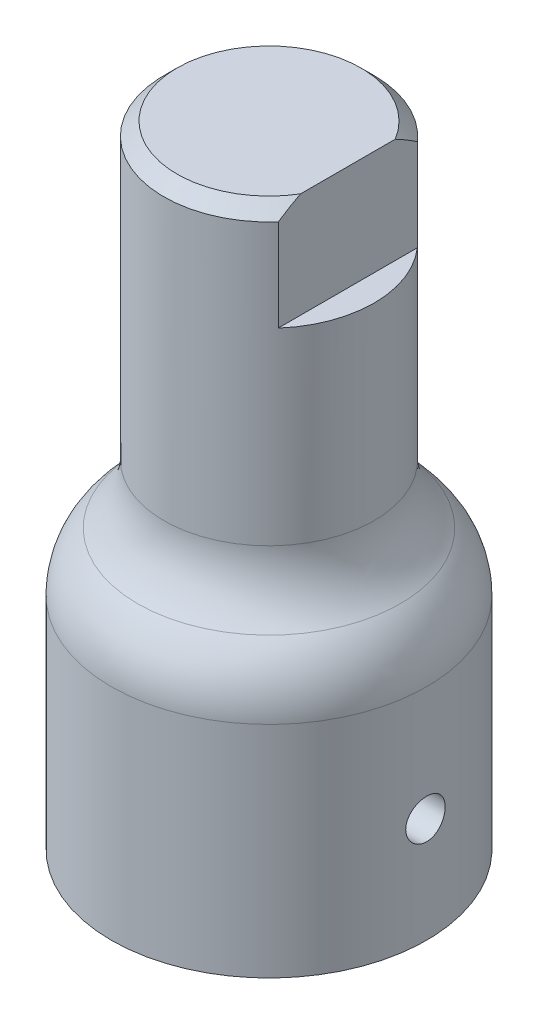
ISO-10303-21;
HEADER;
FILE_DESCRIPTION(('STEP AP214'),'2;1');
FILE_NAME('part.step','',(''),(''),'','','');
FILE_SCHEMA(('AUTOMOTIVE_DESIGN { 1 0 10303 214 1 1 1 1 }'));
ENDSEC;
DATA;
#1=APPLICATION_CONTEXT('core data for automotive mechanical design processes');
#2=APPLICATION_PROTOCOL_DEFINITION('international standard','automotive_design',2000,#1);
#3=PRODUCT_CONTEXT('',#1,'mechanical');
#4=PRODUCT('Part','Part','',(#3));
#5=PRODUCT_RELATED_PRODUCT_CATEGORY('part','',(#4));
#6=PRODUCT_DEFINITION_FORMATION('','',#4);
#7=PRODUCT_DEFINITION_CONTEXT('part definition',#1,'design');
#8=PRODUCT_DEFINITION('design','',#6,#7);
#9=PRODUCT_DEFINITION_SHAPE('','',#8);
#10=(LENGTH_UNIT() NAMED_UNIT(*) SI_UNIT(.MILLI.,.METRE.));
#11=(NAMED_UNIT(*) PLANE_ANGLE_UNIT() SI_UNIT($,.RADIAN.));
#12=(NAMED_UNIT(*) SI_UNIT($,.STERADIAN.) SOLID_ANGLE_UNIT());
#13=UNCERTAINTY_MEASURE_WITH_UNIT(LENGTH_MEASURE(1.E-05),#10,'distance_accuracy_value','');
#14=(GEOMETRIC_REPRESENTATION_CONTEXT(3) GLOBAL_UNCERTAINTY_ASSIGNED_CONTEXT((#13)) GLOBAL_UNIT_ASSIGNED_CONTEXT((#10,
#11,#12)) REPRESENTATION_CONTEXT('',''));
#15=CARTESIAN_POINT('',(0.,0.,0.));
#16=DIRECTION('',(0.,0.,1.));
#17=DIRECTION('',(1.,0.,0.));
#18=AXIS2_PLACEMENT_3D('',#15,#16,#17);
#19=CARTESIAN_POINT('',(0.,38.1,0.));
#20=DIRECTION('',(0.,-1.,0.));
#21=DIRECTION('',(0.,0.,-1.));
#22=AXIS2_PLACEMENT_3D('',#19,#20,#21);
#23=CYLINDRICAL_SURFACE('',#22,6.35);
#24=CARTESIAN_POINT('',(0.,20.3651280605346,0.));
#25=DIRECTION('',(0.,-1.,0.));
#26=DIRECTION('',(0.,0.,-1.));
#27=AXIS2_PLACEMENT_3D('',#24,#25,#26);
#28=CIRCLE('',#27,6.35);
#29=CARTESIAN_POINT('',(0.,20.3651280605346,-6.35000000000001));
#30=VERTEX_POINT('',#29);
#31=EDGE_CURVE('E146',#30,#30,#28,.F.);
#32=ORIENTED_EDGE('',*,*,#31,.T.);
#33=EDGE_LOOP('',(#32));
#34=FACE_BOUND('',#33,.T.);
#35=DIRECTION('',(0.,1.,0.));
#36=VECTOR('',#35,1.);
#37=CARTESIAN_POINT('',(4.7625,31.75,4.20013020631504));
#38=LINE('',#37,#36);
#39=CARTESIAN_POINT('',(4.7625,31.75,4.20013020631504));
#40=VERTEX_POINT('',#39);
#41=CARTESIAN_POINT('',(4.7625,37.30625,4.20013020631504));
#42=VERTEX_POINT('',#41);
#43=EDGE_CURVE('E79',#40,#42,#38,.T.);
#44=ORIENTED_EDGE('',*,*,#43,.T.);
#45=CARTESIAN_POINT('',(0.,37.30625,0.));
#46=DIRECTION('',(0.,1.,0.));
#47=DIRECTION('',(0.,0.,1.));
#48=AXIS2_PLACEMENT_3D('',#45,#46,#47);
#49=CIRCLE('',#48,6.35);
#50=CARTESIAN_POINT('',(4.7625,37.30625,-4.20013020631508));
#51=VERTEX_POINT('',#50);
#52=EDGE_CURVE('E11',#42,#51,#49,.F.);
#53=ORIENTED_EDGE('',*,*,#52,.T.);
#54=DIRECTION('',(0.,1.,0.));
#55=VECTOR('',#54,1.);
#56=CARTESIAN_POINT('',(4.7625,31.75,-4.20013020631508));
#57=LINE('',#56,#55);
#58=CARTESIAN_POINT('',(4.7625,31.75,-4.20013020631508));
#59=VERTEX_POINT('',#58);
#60=EDGE_CURVE('E77',#59,#51,#57,.T.);
#61=ORIENTED_EDGE('',*,*,#60,.F.);
#62=CARTESIAN_POINT('',(0.,31.75,0.));
#63=DIRECTION('',(0.,1.,0.));
#64=DIRECTION('',(0.,0.,1.));
#65=AXIS2_PLACEMENT_3D('',#62,#63,#64);
#66=CIRCLE('',#65,6.35);
#67=EDGE_CURVE('E82',#40,#59,#66,.T.);
#68=ORIENTED_EDGE('',*,*,#67,.F.);
#69=EDGE_LOOP('',(#44,#53,#61,#68));
#70=FACE_BOUND('',#69,.T.);
#71=ADVANCED_FACE('F32',(#34,#70),#23,.T.);
#72=CARTESIAN_POINT('',(0.,38.1,0.));
#73=DIRECTION('',(0.,1.,0.));
#74=DIRECTION('',(0.,0.,1.));
#75=AXIS2_PLACEMENT_3D('',#72,#73,#74);
#76=PLANE('',#75);
#77=DIRECTION('',(0.,0.,-1.));
#78=VECTOR('',#77,1.);
#79=CARTESIAN_POINT('',(4.7625,38.1,4.20013020631504));
#80=LINE('',#79,#78);
#81=CARTESIAN_POINT('',(4.7625,38.1,2.86190632489951));
#82=VERTEX_POINT('',#81);
#83=CARTESIAN_POINT('',(4.7625,38.1,-2.86190632489951));
#84=VERTEX_POINT('',#83);
#85=EDGE_CURVE('E85',#82,#84,#80,.T.);
#86=ORIENTED_EDGE('',*,*,#85,.T.);
#87=CARTESIAN_POINT('',(0.,38.1,0.));
#88=DIRECTION('',(0.,1.,0.));
#89=DIRECTION('',(0.,0.,1.));
#90=AXIS2_PLACEMENT_3D('',#87,#88,#89);
#91=CIRCLE('',#90,5.55624999999999);
#92=EDGE_CURVE('E161',#84,#82,#91,.T.);
#93=ORIENTED_EDGE('',*,*,#92,.T.);
#94=EDGE_LOOP('',(#86,#93));
#95=FACE_BOUND('',#94,.T.);
#96=ADVANCED_FACE('F138',(#95),#76,.T.);
#97=CARTESIAN_POINT('',(0.,0.,0.));
#98=DIRECTION('',(0.,1.,0.));
#99=DIRECTION('',(0.,0.,1.));
#100=AXIS2_PLACEMENT_3D('',#97,#98,#99);
#101=PLANE('',#100);
#102=CARTESIAN_POINT('',(0.,0.,0.));
#103=DIRECTION('',(0.,1.,0.));
#104=DIRECTION('',(0.,0.,1.));
#105=AXIS2_PLACEMENT_3D('',#102,#103,#104);
#106=CIRCLE('',#105,9.525);
#107=CARTESIAN_POINT('',(0.,0.,9.52500000000001));
#108=VERTEX_POINT('',#107);
#109=EDGE_CURVE('E149',#108,#108,#106,.T.);
#110=ORIENTED_EDGE('',*,*,#109,.F.);
#111=EDGE_LOOP('',(#110));
#112=FACE_BOUND('',#111,.T.);
#113=CARTESIAN_POINT('',(0.,0.,0.));
#114=DIRECTION('',(0.,1.,0.));
#115=DIRECTION('',(0.,0.,1.));
#116=AXIS2_PLACEMENT_3D('',#113,#114,#115);
#117=CIRCLE('',#116,6.35);
#118=CARTESIAN_POINT('',(4.7625,0.,-4.20013020631508));
#119=VERTEX_POINT('',#118);
#120=CARTESIAN_POINT('',(4.7625,0.,4.20013020631504));
#121=VERTEX_POINT('',#120);
#122=EDGE_CURVE('E100',#119,#121,#117,.T.);
#123=ORIENTED_EDGE('',*,*,#122,.T.);
#124=DIRECTION('',(0.,0.,-1.));
#125=VECTOR('',#124,1.);
#126=CARTESIAN_POINT('',(4.7625,0.,4.20013020631504));
#127=LINE('',#126,#125);
#128=EDGE_CURVE('E262',#121,#119,#127,.T.);
#129=ORIENTED_EDGE('',*,*,#128,.T.);
#130=EDGE_LOOP('',(#123,#129));
#131=FACE_BOUND('',#130,.T.);
#132=ADVANCED_FACE('F135',(#112,#131),#101,.F.);
#133=CARTESIAN_POINT('',(0.,15.875,0.));
#134=DIRECTION('',(0.,-1.,0.));
#135=DIRECTION('',(0.,0.,-1.));
#136=AXIS2_PLACEMENT_3D('',#133,#134,#135);
#137=CYLINDRICAL_SURFACE('',#136,9.525);
#138=CARTESIAN_POINT('',(9.52500000000002,5.15937499999999,0.));
#139=CARTESIAN_POINT('',(9.52499907081927,5.15937782937063,0.066599321758431));
#140=CARTESIAN_POINT('',(9.52429412394273,5.16498183370437,0.133240259761682));
#141=CARTESIAN_POINT('',(9.52154975978035,5.18724884311434,0.264667746995244));
#142=CARTESIAN_POINT('',(9.51950894913981,5.20392339543601,0.329452286209558));
#143=CARTESIAN_POINT('',(9.51432276572399,5.24783255291408,0.45524526750472));
#144=CARTESIAN_POINT('',(9.51117813655702,5.27506005016194,0.516256219269604));
#145=CARTESIAN_POINT('',(9.50413406293194,5.33928666899061,0.632831224917818));
#146=CARTESIAN_POINT('',(9.50023474798811,5.37628411431275,0.688396210941232));
#147=CARTESIAN_POINT('',(9.49209265522139,5.4592181661111,0.792819479063548));
#148=CARTESIAN_POINT('',(9.48784828372264,5.50519780785114,0.841643461301313));
#149=CARTESIAN_POINT('',(9.47950729512143,5.60469866970932,0.930903392931741));
#150=CARTESIAN_POINT('',(9.47541068555933,5.65822027401493,0.971338914756774));
#151=CARTESIAN_POINT('',(9.46781335551327,5.77150863931565,1.04280183931144));
#152=CARTESIAN_POINT('',(9.4643146875598,5.83129581844673,1.07379711069193));
#153=CARTESIAN_POINT('',(9.45833037427971,5.95527783348992,1.12529449021891));
#154=CARTESIAN_POINT('',(9.45584469053883,6.01947250215376,1.14579699627856));
#155=CARTESIAN_POINT('',(9.45218299236223,6.1500912981482,1.17562263923679));
#156=CARTESIAN_POINT('',(9.4510001961175,6.21650200898162,1.18500368539097));
#157=CARTESIAN_POINT('',(9.45005743403004,6.34996488297846,1.19249930547663));
#158=CARTESIAN_POINT('',(9.45029741096968,6.41701702023828,1.1906143324774));
#159=CARTESIAN_POINT('',(9.45216687494844,6.54945579897724,1.17567895885832));
#160=CARTESIAN_POINT('',(9.45378842328606,6.61484976217788,1.16269234837146));
#161=CARTESIAN_POINT('',(9.45822593884571,6.74252287885555,1.12602186999045));
#162=CARTESIAN_POINT('',(9.46104193026778,6.80480196919507,1.10233778535935));
#163=CARTESIAN_POINT('',(9.46756003930542,6.92467563453408,1.04487609790792));
#164=CARTESIAN_POINT('',(9.4712645849195,6.98225678424357,1.01107077457826));
#165=CARTESIAN_POINT('',(9.47914051318821,7.0909529382143,0.93434604982887));
#166=CARTESIAN_POINT('',(9.48331191719172,7.14206764654497,0.891426231533505));
#167=CARTESIAN_POINT('',(9.49168683585316,7.23675021598171,0.797337326496528));
#168=CARTESIAN_POINT('',(9.49589037311757,7.28026345495354,0.746113256233825));
#169=CARTESIAN_POINT('',(9.50382893754725,7.35808260411454,0.637059226790497));
#170=CARTESIAN_POINT('',(9.50756396363217,7.39238849307253,0.5792292523778));
#171=CARTESIAN_POINT('',(9.51414698744099,7.45081916637093,0.458562870986835));
#172=CARTESIAN_POINT('',(9.51699468708732,7.47494053041093,0.395724790529569));
#173=CARTESIAN_POINT('',(9.52147949227754,7.51227407254045,0.266846656630281));
#174=CARTESIAN_POINT('',(9.52311665449633,7.52548676135527,0.200806753245351));
#175=CARTESIAN_POINT('',(9.52498855290624,7.54055709830409,0.067871894313805));
#176=CARTESIAN_POINT('',(9.5252325821293,7.54248999136338,0.000985594707088864));
#177=CARTESIAN_POINT('',(9.52431580975086,7.53514444165585,-0.13215748738193));
#178=CARTESIAN_POINT('',(9.52315503806674,7.52586623764642,-0.198414283240189));
#179=CARTESIAN_POINT('',(9.51956488620375,7.4964243761962,-0.328195546802372));
#180=CARTESIAN_POINT('',(9.51713968812605,7.47629659642949,-0.391728279164763));
#181=CARTESIAN_POINT('',(9.51129220626468,7.42576423852647,-0.514516523126313));
#182=CARTESIAN_POINT('',(9.50786988862572,7.39535931144345,-0.573771889410353));
#183=CARTESIAN_POINT('',(9.50038655660941,7.32495369326206,-0.686659402977384));
#184=CARTESIAN_POINT('',(9.49632233975244,7.28490432948005,-0.740260978173241));
#185=CARTESIAN_POINT('',(9.48801986532594,7.19641555179933,-0.840008316309541));
#186=CARTESIAN_POINT('',(9.48378160085311,7.14797580486547,-0.886153783157947));
#187=CARTESIAN_POINT('',(9.47558003976556,7.04374984276942,-0.969945970387097));
#188=CARTESIAN_POINT('',(9.47161844586032,6.98792337506967,-1.00754281309548));
#189=CARTESIAN_POINT('',(9.46444677006442,6.87070401088794,-1.07282593859746));
#190=CARTESIAN_POINT('',(9.46123667310902,6.8093112260243,-1.10051242006313));
#191=CARTESIAN_POINT('',(9.45594303749664,6.68286287925594,-1.14510815818519));
#192=CARTESIAN_POINT('',(9.45385656144255,6.61781736343964,-1.16204553632644));
#193=CARTESIAN_POINT('',(9.45103797450925,6.48577769209945,-1.18475283457957));
#194=CARTESIAN_POINT('',(9.4503058006243,6.41878362737452,-1.1905232742077));
#195=CARTESIAN_POINT('',(9.45028055162894,6.28524479746627,-1.19072336281044));
#196=CARTESIAN_POINT('',(9.45097753288118,6.21870013798194,-1.18523137240429));
#197=CARTESIAN_POINT('',(9.45371068298342,6.08748760464941,-1.16322843530948));
#198=CARTESIAN_POINT('',(9.45574685197692,6.02281973100231,-1.14671748744012));
#199=CARTESIAN_POINT('',(9.46092587637629,5.89720676184,-1.1031698188447));
#200=CARTESIAN_POINT('',(9.46406833493563,5.83626034055836,-1.07613687218741));
#201=CARTESIAN_POINT('',(9.47110651770345,5.71975615600948,-1.01232028714908));
#202=CARTESIAN_POINT('',(9.47500225135021,5.6641984602743,-0.975536526591438));
#203=CARTESIAN_POINT('',(9.48314050513251,5.5596482539316,-0.892971765265354));
#204=CARTESIAN_POINT('',(9.4873851658002,5.51070202422019,-0.847132366775326));
#205=CARTESIAN_POINT('',(9.49572411046119,5.42116637451376,-0.747879295593704));
#206=CARTESIAN_POINT('',(9.49981835876251,5.38057892761874,-0.694463839578688));
#207=CARTESIAN_POINT('',(9.50741235699439,5.30878159867861,-0.581342001931836));
#208=CARTESIAN_POINT('',(9.51090978693541,5.27760796494048,-0.521612469407691));
#209=CARTESIAN_POINT('',(9.5168925537279,5.22577794556112,-0.397755857220992));
#210=CARTESIAN_POINT('',(9.51937898969761,5.20511013219917,-0.333633642264451));
#211=CARTESIAN_POINT('',(9.5224602555609,5.17982549019592,-0.224316498899722));
#212=CARTESIAN_POINT('',(9.52340801957709,5.17216757888104,-0.179810884749932));
#213=CARTESIAN_POINT('',(9.52467820420526,5.16194139423859,-0.0902098763549219));
#214=CARTESIAN_POINT('',(9.52500062942854,5.15937308337983,-0.0451144864612328));
#215=CARTESIAN_POINT('',(9.52500000000002,5.15937499999999,0.));
#216=B_SPLINE_CURVE_WITH_KNOTS('',3,(#138,#139,#140,#141,#142,#143,#144,#145,#146,#147,#148,
#149,#150,#151,#152,#153,#154,#155,#156,#157,#158,#159,#160,#161,#162,#163,#164,#165,#166,#167,
#168,#169,#170,#171,#172,#173,#174,#175,#176,#177,#178,#179,#180,#181,#182,#183,#184,#185,#186,
#187,#188,#189,#190,#191,#192,#193,#194,#195,#196,#197,#198,#199,#200,#201,#202,#203,#204,#205,
#206,#207,#208,#209,#210,#211,#212,#213,#214,#215),.UNSPECIFIED.,.T.,.F.,(4,2,2,2,2,2,2,2,2,2,2,
2,2,2,2,2,2,2,2,2,2,2,2,2,2,2,2,2,2,2,2,2,2,2,2,2,2,2,4),(0.,0.199633176159686,
0.399474909524308,0.599182273271578,0.798855394877499,0.99950974787377,1.20017432589753,
1.40151445464361,1.60284694747854,1.80312643542611,2.00339786907572,2.20252621680356,
2.40165859916673,2.60134144268484,2.80103342119617,3.00210606462468,3.20317917170123,
3.40431975217178,3.60545091505425,3.80523883060402,4.00502249144043,4.2041495191673,
4.40328330866349,4.60344394394661,4.80361252592386,5.00492063930482,5.20622471685508,
5.40699995376291,5.6077658498381,5.80713961697555,6.00651340547635,6.20581574766466,
6.40512058720717,6.60575531950734,6.80643735771342,7.00788255696301,7.20910816248271,
7.34434099068109,7.47957282165584),.UNSPECIFIED.);
#217=CARTESIAN_POINT('',(9.52500000000002,5.15937499999999,0.));
#218=VERTEX_POINT('',#217);
#219=EDGE_CURVE('E93',#218,#218,#216,.T.);
#220=ORIENTED_EDGE('',*,*,#219,.T.);
#221=EDGE_LOOP('',(#220));
#222=FACE_BOUND('',#221,.T.);
#223=CARTESIAN_POINT('',(0.,13.2656122319727,0.));
#224=DIRECTION('',(0.,-1.,0.));
#225=DIRECTION('',(0.,0.,-1.));
#226=AXIS2_PLACEMENT_3D('',#223,#224,#225);
#227=CIRCLE('',#226,9.525);
#228=CARTESIAN_POINT('',(0.,13.2656122319727,-9.52500000000001));
#229=VERTEX_POINT('',#228);
#230=EDGE_CURVE('E152',#229,#229,#227,.T.);
#231=ORIENTED_EDGE('',*,*,#230,.T.);
#232=EDGE_LOOP('',(#231));
#233=FACE_BOUND('',#232,.T.);
#234=ORIENTED_EDGE('',*,*,#109,.T.);
#235=EDGE_LOOP('',(#234));
#236=FACE_BOUND('',#235,.T.);
#237=ADVANCED_FACE('F102',(#222,#233,#236),#137,.T.);
#238=CARTESIAN_POINT('',(0.,12.7,0.));
#239=DIRECTION('',(0.,-1.,0.));
#240=DIRECTION('',(0.,0.,-1.));
#241=AXIS2_PLACEMENT_3D('',#238,#239,#240);
#242=CYLINDRICAL_SURFACE('',#241,6.35);
#243=ORIENTED_EDGE('',*,*,#122,.F.);
#244=DIRECTION('',(0.,-1.,0.));
#245=VECTOR('',#244,1.);
#246=CARTESIAN_POINT('',(4.7625,12.7,-4.20013020631508));
#247=LINE('',#246,#245);
#248=CARTESIAN_POINT('',(4.7625,12.7,-4.20013020631508));
#249=VERTEX_POINT('',#248);
#250=EDGE_CURVE('E272',#249,#119,#247,.T.);
#251=ORIENTED_EDGE('',*,*,#250,.F.);
#252=CARTESIAN_POINT('',(0.,12.7,0.));
#253=DIRECTION('',(0.,1.,0.));
#254=DIRECTION('',(0.,0.,1.));
#255=AXIS2_PLACEMENT_3D('',#252,#253,#254);
#256=CIRCLE('',#255,6.35);
#257=CARTESIAN_POINT('',(4.7625,12.7,4.20013020631504));
#258=VERTEX_POINT('',#257);
#259=EDGE_CURVE('E266',#249,#258,#256,.T.);
#260=ORIENTED_EDGE('',*,*,#259,.T.);
#261=DIRECTION('',(0.,-1.,0.));
#262=VECTOR('',#261,1.);
#263=CARTESIAN_POINT('',(4.7625,12.7,4.20013020631504));
#264=LINE('',#263,#262);
#265=EDGE_CURVE('E155',#258,#121,#264,.T.);
#266=ORIENTED_EDGE('',*,*,#265,.T.);
#267=EDGE_LOOP('',(#243,#251,#260,#266));
#268=FACE_BOUND('',#267,.T.);
#269=ADVANCED_FACE('F128',(#268),#242,.F.);
#270=CARTESIAN_POINT('',(4.7625,12.7,4.20013020631504));
#271=DIRECTION('',(-1.,0.,0.));
#272=DIRECTION('',(0.,0.,1.));
#273=AXIS2_PLACEMENT_3D('',#270,#271,#272);
#274=PLANE('',#273);
#275=CARTESIAN_POINT('',(4.7625,6.34999999999999,0.));
#276=DIRECTION('',(-1.,0.,0.));
#277=DIRECTION('',(0.,0.,1.));
#278=AXIS2_PLACEMENT_3D('',#275,#276,#277);
#279=CIRCLE('',#278,1.190625);
#280=CARTESIAN_POINT('',(4.7625,6.34999999999999,1.190625));
#281=VERTEX_POINT('',#280);
#282=EDGE_CURVE('E88',#281,#281,#279,.T.);
#283=ORIENTED_EDGE('',*,*,#282,.F.);
#284=EDGE_LOOP('',(#283));
#285=FACE_BOUND('',#284,.T.);
#286=ORIENTED_EDGE('',*,*,#128,.F.);
#287=ORIENTED_EDGE('',*,*,#265,.F.);
#288=DIRECTION('',(0.,0.,-1.));
#289=VECTOR('',#288,1.);
#290=CARTESIAN_POINT('',(4.7625,12.7,4.20013020631504));
#291=LINE('',#290,#289);
#292=EDGE_CURVE('E268',#258,#249,#291,.T.);
#293=ORIENTED_EDGE('',*,*,#292,.T.);
#294=ORIENTED_EDGE('',*,*,#250,.T.);
#295=EDGE_LOOP('',(#286,#287,#293,#294));
#296=FACE_BOUND('',#295,.T.);
#297=ADVANCED_FACE('F125',(#285,#296),#274,.T.);
#298=CARTESIAN_POINT('',(0.,12.7,0.));
#299=DIRECTION('',(0.,1.,0.));
#300=DIRECTION('',(0.,0.,1.));
#301=AXIS2_PLACEMENT_3D('',#298,#299,#300);
#302=PLANE('',#301);
#303=ORIENTED_EDGE('',*,*,#259,.F.);
#304=ORIENTED_EDGE('',*,*,#292,.F.);
#305=EDGE_LOOP('',(#303,#304));
#306=FACE_BOUND('',#305,.T.);
#307=ADVANCED_FACE('F121',(#306),#302,.F.);
#308=CARTESIAN_POINT('',(0.,20.3651280605346,0.));
#309=DIRECTION('',(0.,-1.,0.));
#310=DIRECTION('',(0.,0.,-1.));
#311=AXIS2_PLACEMENT_3D('',#308,#309,#310);
#312=TOROIDAL_SURFACE('',#311,11.1125,4.7625);
#313=CARTESIAN_POINT('',(0.,16.8153701462537,0.));
#314=DIRECTION('',(0.,1.,0.));
#315=DIRECTION('',(0.,0.,1.));
#316=AXIS2_PLACEMENT_3D('',#313,#314,#315);
#317=CIRCLE('',#316,7.93749999999999);
#318=CARTESIAN_POINT('',(0.,16.8153701462537,7.93750000000001));
#319=VERTEX_POINT('',#318);
#320=EDGE_CURVE('E148',#319,#319,#317,.T.);
#321=ORIENTED_EDGE('',*,*,#320,.T.);
#322=EDGE_LOOP('',(#321));
#323=FACE_BOUND('',#322,.T.);
#324=ORIENTED_EDGE('',*,*,#31,.F.);
#325=EDGE_LOOP('',(#324));
#326=FACE_BOUND('',#325,.T.);
#327=ADVANCED_FACE('F117',(#323,#326),#312,.F.);
#328=CARTESIAN_POINT('',(0.,13.2656122319727,0.));
#329=DIRECTION('',(0.,-1.,0.));
#330=DIRECTION('',(0.,0.,-1.));
#331=AXIS2_PLACEMENT_3D('',#328,#329,#330);
#332=DEGENERATE_TOROIDAL_SURFACE('',#331,4.7625,4.7625,.T.);
#333=ORIENTED_EDGE('',*,*,#230,.F.);
#334=EDGE_LOOP('',(#333));
#335=FACE_BOUND('',#334,.T.);
#336=ORIENTED_EDGE('',*,*,#320,.F.);
#337=EDGE_LOOP('',(#336));
#338=FACE_BOUND('',#337,.T.);
#339=ADVANCED_FACE('F111',(#335,#338),#332,.T.);
#340=CARTESIAN_POINT('',(9.52500000000002,6.34999999999999,0.));
#341=DIRECTION('',(-1.,0.,0.));
#342=DIRECTION('',(0.,0.,1.));
#343=AXIS2_PLACEMENT_3D('',#340,#341,#342);
#344=CYLINDRICAL_SURFACE('',#343,1.190625);
#345=ORIENTED_EDGE('',*,*,#282,.T.);
#346=EDGE_LOOP('',(#345));
#347=FACE_BOUND('',#346,.T.);
#348=ORIENTED_EDGE('',*,*,#219,.F.);
#349=EDGE_LOOP('',(#348));
#350=FACE_BOUND('',#349,.T.);
#351=ADVANCED_FACE('F106',(#347,#350),#344,.F.);
#352=CARTESIAN_POINT('',(4.7625,31.75,4.20013020631504));
#353=DIRECTION('',(1.,0.,0.));
#354=DIRECTION('',(0.,0.,-1.));
#355=AXIS2_PLACEMENT_3D('',#352,#353,#354);
#356=PLANE('',#355);
#357=ORIENTED_EDGE('',*,*,#85,.F.);
#358=CARTESIAN_POINT('',(4.7625,38.1,2.86190632489951));
#359=CARTESIAN_POINT('',(4.7625,38.0405523803319,2.97728473468102));
#360=CARTESIAN_POINT('',(4.7625,37.9790569609474,3.09158529699657));
#361=CARTESIAN_POINT('',(4.7625,37.8525824129198,3.31813666600112));
#362=CARTESIAN_POINT('',(4.7625,37.7876058580941,3.43038890701487));
#363=CARTESIAN_POINT('',(4.7625,37.6547025930422,3.6531005161684));
#364=CARTESIAN_POINT('',(4.7625,37.5867763300089,3.76356015261344));
#365=CARTESIAN_POINT('',(4.7625,37.4483372325312,3.98296117478161));
#366=CARTESIAN_POINT('',(4.7625,37.3778225485784,4.09190139499944));
#367=CARTESIAN_POINT('',(4.7625,37.30625,4.20013020631504));
#368=B_SPLINE_CURVE_WITH_KNOTS('',3,(#358,#359,#360,#361,#362,#363,#364,#365,#366,#367),
.UNSPECIFIED.,.F.,.F.,(4,2,2,2,4),(0.,0.389329079905572,0.778374174152334,1.1673604914207,
1.55663037919006),.UNSPECIFIED.);
#369=EDGE_CURVE('E39',#82,#42,#368,.T.);
#370=ORIENTED_EDGE('',*,*,#369,.T.);
#371=ORIENTED_EDGE('',*,*,#43,.F.);
#372=DIRECTION('',(0.,0.,-1.));
#373=VECTOR('',#372,1.);
#374=CARTESIAN_POINT('',(4.7625,31.75,4.20013020631504));
#375=LINE('',#374,#373);
#376=EDGE_CURVE('E74',#40,#59,#375,.T.);
#377=ORIENTED_EDGE('',*,*,#376,.T.);
#378=ORIENTED_EDGE('',*,*,#60,.T.);
#379=CARTESIAN_POINT('',(4.7625,37.30625,-4.20013020631508));
#380=CARTESIAN_POINT('',(4.7625,37.3778225485784,-4.09190139499947));
#381=CARTESIAN_POINT('',(4.7625,37.4483372325312,-3.98296117478163));
#382=CARTESIAN_POINT('',(4.7625,37.5867763300088,-3.76356015261345));
#383=CARTESIAN_POINT('',(4.7625,37.6547025930421,-3.65310051616841));
#384=CARTESIAN_POINT('',(4.7625,37.7876058580941,-3.43038890701488));
#385=CARTESIAN_POINT('',(4.7625,37.8525824129198,-3.31813666600113));
#386=CARTESIAN_POINT('',(4.7625,37.9790569609474,-3.09158529699657));
#387=CARTESIAN_POINT('',(4.7625,38.0405523803319,-2.97728473468103));
#388=CARTESIAN_POINT('',(4.7625,38.1,-2.86190632489951));
#389=B_SPLINE_CURVE_WITH_KNOTS('',3,(#379,#380,#381,#382,#383,#384,#385,#386,#387,#388),
.UNSPECIFIED.,.F.,.F.,(4,2,2,2,4),(0.,0.38926988776938,0.778256205037747,1.16730129928451,
1.55663037919009),.UNSPECIFIED.);
#390=EDGE_CURVE('E164',#51,#84,#389,.T.);
#391=ORIENTED_EDGE('',*,*,#390,.T.);
#392=EDGE_LOOP('',(#357,#370,#371,#377,#378,#391));
#393=FACE_BOUND('',#392,.T.);
#394=ADVANCED_FACE('F76',(#393),#356,.T.);
#395=CARTESIAN_POINT('',(0.,31.75,0.));
#396=DIRECTION('',(0.,1.,0.));
#397=DIRECTION('',(0.,0.,1.));
#398=AXIS2_PLACEMENT_3D('',#395,#396,#397);
#399=PLANE('',#398);
#400=ORIENTED_EDGE('',*,*,#67,.T.);
#401=ORIENTED_EDGE('',*,*,#376,.F.);
#402=EDGE_LOOP('',(#400,#401));
#403=FACE_BOUND('',#402,.T.);
#404=ADVANCED_FACE('F84',(#403),#399,.T.);
#405=CARTESIAN_POINT('',(0.,38.1,0.));
#406=DIRECTION('',(0.,-1.,0.));
#407=DIRECTION('',(0.,0.,-1.));
#408=AXIS2_PLACEMENT_3D('',#405,#406,#407);
#409=CONICAL_SURFACE('',#408,5.55624999999999,0.785398163397455);
#410=ORIENTED_EDGE('',*,*,#390,.F.);
#411=ORIENTED_EDGE('',*,*,#52,.F.);
#412=ORIENTED_EDGE('',*,*,#369,.F.);
#413=ORIENTED_EDGE('',*,*,#92,.F.);
#414=EDGE_LOOP('',(#410,#411,#412,#413));
#415=FACE_BOUND('',#414,.T.);
#416=ADVANCED_FACE('F172',(#415),#409,.T.);
#417=CLOSED_SHELL('',(#71,#96,#132,#237,#269,#297,#307,#327,#339,#351,#394,#404,#416));
#418=MANIFOLD_SOLID_BREP('B2',#417);
#419=ADVANCED_BREP_SHAPE_REPRESENTATION('',(#18,#418),#14);
#420=SHAPE_DEFINITION_REPRESENTATION(#9,#419);
ENDSEC;
END-ISO-10303-21;
